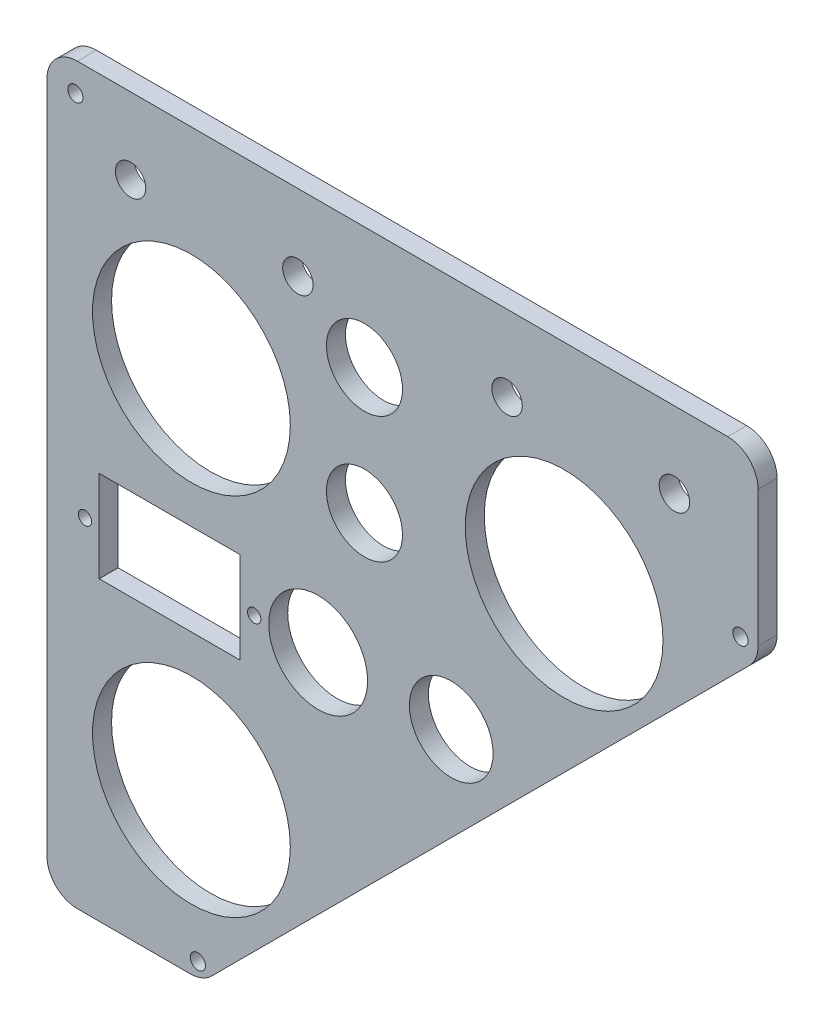
ISO-10303-21;
HEADER;
FILE_DESCRIPTION(('STEP AP214'),'2;1');
FILE_NAME('part.step','',(''),(''),'','','');
FILE_SCHEMA(('AUTOMOTIVE_DESIGN { 1 0 10303 214 1 1 1 1 }'));
ENDSEC;
DATA;
#1=APPLICATION_CONTEXT('core data for automotive mechanical design processes');
#2=APPLICATION_PROTOCOL_DEFINITION('international standard','automotive_design',2000,#1);
#3=PRODUCT_CONTEXT('',#1,'mechanical');
#4=PRODUCT('Part','Part','',(#3));
#5=PRODUCT_RELATED_PRODUCT_CATEGORY('part','',(#4));
#6=PRODUCT_DEFINITION_FORMATION('','',#4);
#7=PRODUCT_DEFINITION_CONTEXT('part definition',#1,'design');
#8=PRODUCT_DEFINITION('design','',#6,#7);
#9=PRODUCT_DEFINITION_SHAPE('','',#8);
#10=(LENGTH_UNIT() NAMED_UNIT(*) SI_UNIT(.MILLI.,.METRE.));
#11=(NAMED_UNIT(*) PLANE_ANGLE_UNIT() SI_UNIT($,.RADIAN.));
#12=(NAMED_UNIT(*) SI_UNIT($,.STERADIAN.) SOLID_ANGLE_UNIT());
#13=UNCERTAINTY_MEASURE_WITH_UNIT(LENGTH_MEASURE(1.E-05),#10,'distance_accuracy_value','');
#14=(GEOMETRIC_REPRESENTATION_CONTEXT(3) GLOBAL_UNCERTAINTY_ASSIGNED_CONTEXT((#13)) GLOBAL_UNIT_ASSIGNED_CONTEXT((#10,
#11,#12)) REPRESENTATION_CONTEXT('',''));
#15=CARTESIAN_POINT('',(0.,0.,0.));
#16=DIRECTION('',(0.,0.,1.));
#17=DIRECTION('',(1.,0.,0.));
#18=AXIS2_PLACEMENT_3D('',#15,#16,#17);
#19=CARTESIAN_POINT('',(8.,185.,5.));
#20=DIRECTION('',(0.,0.,-1.));
#21=DIRECTION('',(-1.,0.,0.));
#22=AXIS2_PLACEMENT_3D('',#19,#20,#21);
#23=CYLINDRICAL_SURFACE('',#22,8.);
#24=CARTESIAN_POINT('',(8.,185.,0.));
#25=DIRECTION('',(0.,0.,1.));
#26=DIRECTION('',(-1.,0.,0.));
#27=AXIS2_PLACEMENT_3D('',#24,#25,#26);
#28=CIRCLE('',#27,8.);
#29=CARTESIAN_POINT('',(8.,193.,0.));
#30=VERTEX_POINT('',#29);
#31=CARTESIAN_POINT('',(0.,185.,0.));
#32=VERTEX_POINT('',#31);
#33=EDGE_CURVE('E188',#30,#32,#28,.T.);
#34=ORIENTED_EDGE('',*,*,#33,.T.);
#35=DIRECTION('',(0.,0.,-1.));
#36=VECTOR('',#35,1.);
#37=CARTESIAN_POINT('',(0.,185.,5.));
#38=LINE('',#37,#36);
#39=CARTESIAN_POINT('',(0.,185.,5.));
#40=VERTEX_POINT('',#39);
#41=EDGE_CURVE('E235',#40,#32,#38,.T.);
#42=ORIENTED_EDGE('',*,*,#41,.F.);
#43=CARTESIAN_POINT('',(8.,185.,5.));
#44=DIRECTION('',(0.,0.,1.));
#45=DIRECTION('',(-1.,0.,0.));
#46=AXIS2_PLACEMENT_3D('',#43,#44,#45);
#47=CIRCLE('',#46,8.);
#48=CARTESIAN_POINT('',(8.,193.,5.));
#49=VERTEX_POINT('',#48);
#50=EDGE_CURVE('E165',#49,#40,#47,.T.);
#51=ORIENTED_EDGE('',*,*,#50,.F.);
#52=DIRECTION('',(0.,0.,-1.));
#53=VECTOR('',#52,1.);
#54=CARTESIAN_POINT('',(8.,193.,5.));
#55=LINE('',#54,#53);
#56=EDGE_CURVE('E187',#49,#30,#55,.T.);
#57=ORIENTED_EDGE('',*,*,#56,.T.);
#58=EDGE_LOOP('',(#34,#42,#51,#57));
#59=FACE_BOUND('',#58,.T.);
#60=ADVANCED_FACE('F35',(#59),#23,.T.);
#61=CARTESIAN_POINT('',(0.,8.,5.));
#62=DIRECTION('',(1.,0.,0.));
#63=DIRECTION('',(0.,1.,0.));
#64=AXIS2_PLACEMENT_3D('',#61,#62,#63);
#65=PLANE('',#64);
#66=DIRECTION('',(0.,-1.,0.));
#67=VECTOR('',#66,1.);
#68=CARTESIAN_POINT('',(0.,8.,0.));
#69=LINE('',#68,#67);
#70=CARTESIAN_POINT('',(0.,8.,0.));
#71=VERTEX_POINT('',#70);
#72=EDGE_CURVE('E191',#32,#71,#69,.T.);
#73=ORIENTED_EDGE('',*,*,#72,.T.);
#74=DIRECTION('',(0.,0.,-1.));
#75=VECTOR('',#74,1.);
#76=CARTESIAN_POINT('',(0.,8.,5.));
#77=LINE('',#76,#75);
#78=CARTESIAN_POINT('',(0.,8.,5.));
#79=VERTEX_POINT('',#78);
#80=EDGE_CURVE('E232',#79,#71,#77,.T.);
#81=ORIENTED_EDGE('',*,*,#80,.F.);
#82=DIRECTION('',(0.,-1.,0.));
#83=VECTOR('',#82,1.);
#84=CARTESIAN_POINT('',(0.,8.,5.));
#85=LINE('',#84,#83);
#86=EDGE_CURVE('E168',#40,#79,#85,.T.);
#87=ORIENTED_EDGE('',*,*,#86,.F.);
#88=ORIENTED_EDGE('',*,*,#41,.T.);
#89=EDGE_LOOP('',(#73,#81,#87,#88));
#90=FACE_BOUND('',#89,.T.);
#91=ADVANCED_FACE('F373',(#90),#65,.F.);
#92=CARTESIAN_POINT('',(8.,8.,5.));
#93=DIRECTION('',(0.,0.,-1.));
#94=DIRECTION('',(-1.,0.,0.));
#95=AXIS2_PLACEMENT_3D('',#92,#93,#94);
#96=CYLINDRICAL_SURFACE('',#95,8.);
#97=CARTESIAN_POINT('',(8.,8.,0.));
#98=DIRECTION('',(0.,0.,1.));
#99=DIRECTION('',(1.,0.,0.));
#100=AXIS2_PLACEMENT_3D('',#97,#98,#99);
#101=CIRCLE('',#100,8.);
#102=CARTESIAN_POINT('',(8.,0.,0.));
#103=VERTEX_POINT('',#102);
#104=EDGE_CURVE('E194',#71,#103,#101,.T.);
#105=ORIENTED_EDGE('',*,*,#104,.T.);
#106=DIRECTION('',(0.,0.,-1.));
#107=VECTOR('',#106,1.);
#108=CARTESIAN_POINT('',(8.,0.,5.));
#109=LINE('',#108,#107);
#110=CARTESIAN_POINT('',(8.,0.,5.));
#111=VERTEX_POINT('',#110);
#112=EDGE_CURVE('E229',#111,#103,#109,.T.);
#113=ORIENTED_EDGE('',*,*,#112,.F.);
#114=CARTESIAN_POINT('',(8.,8.,5.));
#115=DIRECTION('',(0.,0.,1.));
#116=DIRECTION('',(1.,0.,0.));
#117=AXIS2_PLACEMENT_3D('',#114,#115,#116);
#118=CIRCLE('',#117,8.);
#119=EDGE_CURVE('E171',#79,#111,#118,.T.);
#120=ORIENTED_EDGE('',*,*,#119,.F.);
#121=ORIENTED_EDGE('',*,*,#80,.T.);
#122=EDGE_LOOP('',(#105,#113,#120,#121));
#123=FACE_BOUND('',#122,.T.);
#124=ADVANCED_FACE('F378',(#123),#96,.T.);
#125=CARTESIAN_POINT('',(37.6862915010168,0.,5.));
#126=DIRECTION('',(0.,1.,0.));
#127=DIRECTION('',(-1.,0.,0.));
#128=AXIS2_PLACEMENT_3D('',#125,#126,#127);
#129=PLANE('',#128);
#130=DIRECTION('',(1.,0.,0.));
#131=VECTOR('',#130,1.);
#132=CARTESIAN_POINT('',(37.6862915010168,0.,0.));
#133=LINE('',#132,#131);
#134=CARTESIAN_POINT('',(37.6862915010168,0.,0.));
#135=VERTEX_POINT('',#134);
#136=EDGE_CURVE('E196',#103,#135,#133,.T.);
#137=ORIENTED_EDGE('',*,*,#136,.T.);
#138=DIRECTION('',(0.,0.,-1.));
#139=VECTOR('',#138,1.);
#140=CARTESIAN_POINT('',(37.6862915010168,0.,5.));
#141=LINE('',#140,#139);
#142=CARTESIAN_POINT('',(37.6862915010168,0.,5.));
#143=VERTEX_POINT('',#142);
#144=EDGE_CURVE('E226',#143,#135,#141,.T.);
#145=ORIENTED_EDGE('',*,*,#144,.F.);
#146=DIRECTION('',(1.,0.,0.));
#147=VECTOR('',#146,1.);
#148=CARTESIAN_POINT('',(37.6862915010168,0.,5.));
#149=LINE('',#148,#147);
#150=EDGE_CURVE('E173',#111,#143,#149,.T.);
#151=ORIENTED_EDGE('',*,*,#150,.F.);
#152=ORIENTED_EDGE('',*,*,#112,.T.);
#153=EDGE_LOOP('',(#137,#145,#151,#152));
#154=FACE_BOUND('',#153,.T.);
#155=ADVANCED_FACE('F420',(#154),#129,.F.);
#156=CARTESIAN_POINT('',(37.6862915010168,8.00000000000001,5.));
#157=DIRECTION('',(0.,0.,-1.));
#158=DIRECTION('',(-1.,0.,0.));
#159=AXIS2_PLACEMENT_3D('',#156,#157,#158);
#160=CYLINDRICAL_SURFACE('',#159,8.);
#161=CARTESIAN_POINT('',(37.6862915010168,8.00000000000001,0.));
#162=DIRECTION('',(0.,0.,1.));
#163=DIRECTION('',(-1.,0.,0.));
#164=AXIS2_PLACEMENT_3D('',#161,#162,#163);
#165=CIRCLE('',#164,8.);
#166=CARTESIAN_POINT('',(43.3431457505092,2.34314575050765,0.));
#167=VERTEX_POINT('',#166);
#168=EDGE_CURVE('E198',#135,#167,#165,.T.);
#169=ORIENTED_EDGE('',*,*,#168,.T.);
#170=DIRECTION('',(0.,0.,-1.));
#171=VECTOR('',#170,1.);
#172=CARTESIAN_POINT('',(43.3431457505092,2.34314575050765,5.));
#173=LINE('',#172,#171);
#174=CARTESIAN_POINT('',(43.3431457505092,2.34314575050765,5.));
#175=VERTEX_POINT('',#174);
#176=EDGE_CURVE('E223',#175,#167,#173,.T.);
#177=ORIENTED_EDGE('',*,*,#176,.F.);
#178=CARTESIAN_POINT('',(37.6862915010168,8.00000000000001,5.));
#179=DIRECTION('',(0.,0.,1.));
#180=DIRECTION('',(-1.,0.,0.));
#181=AXIS2_PLACEMENT_3D('',#178,#179,#180);
#182=CIRCLE('',#181,8.);
#183=EDGE_CURVE('E175',#143,#175,#182,.T.);
#184=ORIENTED_EDGE('',*,*,#183,.F.);
#185=ORIENTED_EDGE('',*,*,#144,.T.);
#186=EDGE_LOOP('',(#169,#177,#184,#185));
#187=FACE_BOUND('',#186,.T.);
#188=ADVANCED_FACE('F415',(#187),#160,.T.);
#189=CARTESIAN_POINT('',(184.656854249492,143.656854249492,5.));
#190=DIRECTION('',(-0.707106781186552,0.707106781186544,0.));
#191=DIRECTION('',(-0.707106781186544,-0.707106781186552,0.));
#192=AXIS2_PLACEMENT_3D('',#189,#190,#191);
#193=PLANE('',#192);
#194=DIRECTION('',(0.707106781186543,0.707106781186551,0.));
#195=VECTOR('',#194,1.);
#196=CARTESIAN_POINT('',(184.656854249492,143.656854249492,0.));
#197=LINE('',#196,#195);
#198=CARTESIAN_POINT('',(184.656854249492,143.656854249492,0.));
#199=VERTEX_POINT('',#198);
#200=EDGE_CURVE('E200',#167,#199,#197,.T.);
#201=ORIENTED_EDGE('',*,*,#200,.T.);
#202=DIRECTION('',(0.,0.,-1.));
#203=VECTOR('',#202,1.);
#204=CARTESIAN_POINT('',(184.656854249492,143.656854249492,5.));
#205=LINE('',#204,#203);
#206=CARTESIAN_POINT('',(184.656854249492,143.656854249492,5.));
#207=VERTEX_POINT('',#206);
#208=EDGE_CURVE('E220',#207,#199,#205,.T.);
#209=ORIENTED_EDGE('',*,*,#208,.F.);
#210=DIRECTION('',(0.707106781186543,0.707106781186551,0.));
#211=VECTOR('',#210,1.);
#212=CARTESIAN_POINT('',(184.656854249492,143.656854249492,5.));
#213=LINE('',#212,#211);
#214=EDGE_CURVE('E177',#175,#207,#213,.T.);
#215=ORIENTED_EDGE('',*,*,#214,.F.);
#216=ORIENTED_EDGE('',*,*,#176,.T.);
#217=EDGE_LOOP('',(#201,#209,#215,#216));
#218=FACE_BOUND('',#217,.T.);
#219=ADVANCED_FACE('F411',(#218),#193,.F.);
#220=CARTESIAN_POINT('',(179.,149.313708498985,5.));
#221=DIRECTION('',(0.,0.,-1.));
#222=DIRECTION('',(-1.,0.,0.));
#223=AXIS2_PLACEMENT_3D('',#220,#221,#222);
#224=CYLINDRICAL_SURFACE('',#223,7.99999999999998);
#225=CARTESIAN_POINT('',(179.,149.313708498985,0.));
#226=DIRECTION('',(0.,0.,1.));
#227=DIRECTION('',(-1.,0.,0.));
#228=AXIS2_PLACEMENT_3D('',#225,#226,#227);
#229=CIRCLE('',#228,7.99999999999998);
#230=CARTESIAN_POINT('',(187.,149.313708498985,0.));
#231=VERTEX_POINT('',#230);
#232=EDGE_CURVE('E202',#199,#231,#229,.T.);
#233=ORIENTED_EDGE('',*,*,#232,.T.);
#234=DIRECTION('',(0.,0.,-1.));
#235=VECTOR('',#234,1.);
#236=CARTESIAN_POINT('',(187.,149.313708498985,5.));
#237=LINE('',#236,#235);
#238=CARTESIAN_POINT('',(187.,149.313708498985,5.));
#239=VERTEX_POINT('',#238);
#240=EDGE_CURVE('E217',#239,#231,#237,.T.);
#241=ORIENTED_EDGE('',*,*,#240,.F.);
#242=CARTESIAN_POINT('',(179.,149.313708498985,5.));
#243=DIRECTION('',(0.,0.,1.));
#244=DIRECTION('',(-1.,0.,0.));
#245=AXIS2_PLACEMENT_3D('',#242,#243,#244);
#246=CIRCLE('',#245,7.99999999999998);
#247=EDGE_CURVE('E179',#207,#239,#246,.T.);
#248=ORIENTED_EDGE('',*,*,#247,.F.);
#249=ORIENTED_EDGE('',*,*,#208,.T.);
#250=EDGE_LOOP('',(#233,#241,#248,#249));
#251=FACE_BOUND('',#250,.T.);
#252=ADVANCED_FACE('F407',(#251),#224,.T.);
#253=CARTESIAN_POINT('',(187.,185.,5.));
#254=DIRECTION('',(-1.,0.,0.));
#255=DIRECTION('',(0.,0.,1.));
#256=AXIS2_PLACEMENT_3D('',#253,#254,#255);
#257=PLANE('',#256);
#258=DIRECTION('',(0.,1.,0.));
#259=VECTOR('',#258,1.);
#260=CARTESIAN_POINT('',(187.,185.,0.));
#261=LINE('',#260,#259);
#262=CARTESIAN_POINT('',(187.,185.,0.));
#263=VERTEX_POINT('',#262);
#264=EDGE_CURVE('E204',#231,#263,#261,.T.);
#265=ORIENTED_EDGE('',*,*,#264,.T.);
#266=DIRECTION('',(0.,0.,-1.));
#267=VECTOR('',#266,1.);
#268=CARTESIAN_POINT('',(187.,185.,5.));
#269=LINE('',#268,#267);
#270=CARTESIAN_POINT('',(187.,185.,5.));
#271=VERTEX_POINT('',#270);
#272=EDGE_CURVE('E214',#271,#263,#269,.T.);
#273=ORIENTED_EDGE('',*,*,#272,.F.);
#274=DIRECTION('',(0.,1.,0.));
#275=VECTOR('',#274,1.);
#276=CARTESIAN_POINT('',(187.,185.,5.));
#277=LINE('',#276,#275);
#278=EDGE_CURVE('E181',#239,#271,#277,.T.);
#279=ORIENTED_EDGE('',*,*,#278,.F.);
#280=ORIENTED_EDGE('',*,*,#240,.T.);
#281=EDGE_LOOP('',(#265,#273,#279,#280));
#282=FACE_BOUND('',#281,.T.);
#283=ADVANCED_FACE('F402',(#282),#257,.F.);
#284=CARTESIAN_POINT('',(179.,185.,5.));
#285=DIRECTION('',(0.,0.,-1.));
#286=DIRECTION('',(-1.,0.,0.));
#287=AXIS2_PLACEMENT_3D('',#284,#285,#286);
#288=CYLINDRICAL_SURFACE('',#287,8.00000000000001);
#289=CARTESIAN_POINT('',(179.,185.,0.));
#290=DIRECTION('',(0.,0.,1.));
#291=DIRECTION('',(-1.,0.,0.));
#292=AXIS2_PLACEMENT_3D('',#289,#290,#291);
#293=CIRCLE('',#292,8.00000000000001);
#294=CARTESIAN_POINT('',(179.,193.,0.));
#295=VERTEX_POINT('',#294);
#296=EDGE_CURVE('E206',#263,#295,#293,.T.);
#297=ORIENTED_EDGE('',*,*,#296,.T.);
#298=DIRECTION('',(0.,0.,-1.));
#299=VECTOR('',#298,1.);
#300=CARTESIAN_POINT('',(179.,193.,5.));
#301=LINE('',#300,#299);
#302=CARTESIAN_POINT('',(179.,193.,5.));
#303=VERTEX_POINT('',#302);
#304=EDGE_CURVE('E211',#303,#295,#301,.T.);
#305=ORIENTED_EDGE('',*,*,#304,.F.);
#306=CARTESIAN_POINT('',(179.,185.,5.));
#307=DIRECTION('',(0.,0.,1.));
#308=DIRECTION('',(-1.,0.,0.));
#309=AXIS2_PLACEMENT_3D('',#306,#307,#308);
#310=CIRCLE('',#309,8.00000000000001);
#311=EDGE_CURVE('E183',#271,#303,#310,.T.);
#312=ORIENTED_EDGE('',*,*,#311,.F.);
#313=ORIENTED_EDGE('',*,*,#272,.T.);
#314=EDGE_LOOP('',(#297,#305,#312,#313));
#315=FACE_BOUND('',#314,.T.);
#316=ADVANCED_FACE('F396',(#315),#288,.T.);
#317=CARTESIAN_POINT('',(8.,193.,5.));
#318=DIRECTION('',(0.,-1.,0.));
#319=DIRECTION('',(0.,0.,-1.));
#320=AXIS2_PLACEMENT_3D('',#317,#318,#319);
#321=PLANE('',#320);
#322=DIRECTION('',(-1.,0.,0.));
#323=VECTOR('',#322,1.);
#324=CARTESIAN_POINT('',(8.,193.,0.));
#325=LINE('',#324,#323);
#326=EDGE_CURVE('E169',#295,#30,#325,.T.);
#327=ORIENTED_EDGE('',*,*,#326,.T.);
#328=ORIENTED_EDGE('',*,*,#56,.F.);
#329=DIRECTION('',(-1.,0.,0.));
#330=VECTOR('',#329,1.);
#331=CARTESIAN_POINT('',(8.,193.,5.));
#332=LINE('',#331,#330);
#333=EDGE_CURVE('E185',#303,#49,#332,.T.);
#334=ORIENTED_EDGE('',*,*,#333,.F.);
#335=ORIENTED_EDGE('',*,*,#304,.T.);
#336=EDGE_LOOP('',(#327,#328,#334,#335));
#337=FACE_BOUND('',#336,.T.);
#338=ADVANCED_FACE('F346',(#337),#321,.F.);
#339=CARTESIAN_POINT('',(8.,185.,5.));
#340=DIRECTION('',(0.,0.,-1.));
#341=DIRECTION('',(-1.,0.,0.));
#342=AXIS2_PLACEMENT_3D('',#339,#340,#341);
#343=PLANE('',#342);
#344=CARTESIAN_POINT('',(182.36,149.12,5.));
#345=DIRECTION('',(0.,0.,-1.));
#346=DIRECTION('',(-1.,0.,0.));
#347=AXIS2_PLACEMENT_3D('',#344,#345,#346);
#348=CIRCLE('',#347,2.);
#349=CARTESIAN_POINT('',(180.36,149.12,5.));
#350=VERTEX_POINT('',#349);
#351=EDGE_CURVE('E38',#350,#350,#348,.T.);
#352=ORIENTED_EDGE('',*,*,#351,.T.);
#353=EDGE_LOOP('',(#352));
#354=FACE_BOUND('',#353,.T.);
#355=CARTESIAN_POINT('',(7.49999999999996,185.4,5.));
#356=DIRECTION('',(0.,0.,-1.));
#357=DIRECTION('',(-1.,0.,0.));
#358=AXIS2_PLACEMENT_3D('',#355,#356,#357);
#359=CIRCLE('',#358,1.99999999999999);
#360=CARTESIAN_POINT('',(5.49999999999996,185.4,5.));
#361=VERTEX_POINT('',#360);
#362=EDGE_CURVE('E285',#361,#361,#359,.T.);
#363=ORIENTED_EDGE('',*,*,#362,.T.);
#364=EDGE_LOOP('',(#363));
#365=FACE_BOUND('',#364,.T.);
#366=CARTESIAN_POINT('',(39.6899999999999,3.83000000000003,5.));
#367=DIRECTION('',(0.,0.,-1.));
#368=DIRECTION('',(-1.,0.,0.));
#369=AXIS2_PLACEMENT_3D('',#366,#367,#368);
#370=CIRCLE('',#369,1.99999999999999);
#371=CARTESIAN_POINT('',(37.6899999999999,3.83000000000003,5.));
#372=VERTEX_POINT('',#371);
#373=EDGE_CURVE('E281',#372,#372,#370,.T.);
#374=ORIENTED_EDGE('',*,*,#373,.T.);
#375=EDGE_LOOP('',(#374));
#376=FACE_BOUND('',#375,.T.);
#377=CARTESIAN_POINT('',(22.,173.,5.));
#378=DIRECTION('',(0.,0.,1.));
#379=DIRECTION('',(1.,0.,0.));
#380=AXIS2_PLACEMENT_3D('',#377,#378,#379);
#381=CIRCLE('',#380,4.);
#382=CARTESIAN_POINT('',(26.,173.,5.));
#383=VERTEX_POINT('',#382);
#384=EDGE_CURVE('E271',#383,#383,#381,.T.);
#385=ORIENTED_EDGE('',*,*,#384,.F.);
#386=EDGE_LOOP('',(#385));
#387=FACE_BOUND('',#386,.T.);
#388=CARTESIAN_POINT('',(66.,173.,5.));
#389=DIRECTION('',(0.,0.,1.));
#390=DIRECTION('',(1.,0.,0.));
#391=AXIS2_PLACEMENT_3D('',#388,#389,#390);
#392=CIRCLE('',#391,4.00000000000002);
#393=CARTESIAN_POINT('',(70.,173.,5.));
#394=VERTEX_POINT('',#393);
#395=EDGE_CURVE('E306',#394,#394,#392,.T.);
#396=ORIENTED_EDGE('',*,*,#395,.F.);
#397=EDGE_LOOP('',(#396));
#398=FACE_BOUND('',#397,.T.);
#399=CARTESIAN_POINT('',(121.,173.,5.));
#400=DIRECTION('',(0.,0.,1.));
#401=DIRECTION('',(1.,0.,0.));
#402=AXIS2_PLACEMENT_3D('',#399,#400,#401);
#403=CIRCLE('',#402,4.00000000000001);
#404=CARTESIAN_POINT('',(125.,173.,5.));
#405=VERTEX_POINT('',#404);
#406=EDGE_CURVE('E309',#405,#405,#403,.T.);
#407=ORIENTED_EDGE('',*,*,#406,.F.);
#408=EDGE_LOOP('',(#407));
#409=FACE_BOUND('',#408,.T.);
#410=CARTESIAN_POINT('',(165.,173.,5.));
#411=DIRECTION('',(0.,0.,1.));
#412=DIRECTION('',(1.,0.,0.));
#413=AXIS2_PLACEMENT_3D('',#410,#411,#412);
#414=CIRCLE('',#413,3.99999999999999);
#415=CARTESIAN_POINT('',(169.,173.,5.));
#416=VERTEX_POINT('',#415);
#417=EDGE_CURVE('E283',#416,#416,#414,.T.);
#418=ORIENTED_EDGE('',*,*,#417,.F.);
#419=EDGE_LOOP('',(#418));
#420=FACE_BOUND('',#419,.T.);
#421=CARTESIAN_POINT('',(136.,138.,5.));
#422=DIRECTION('',(0.,0.,1.));
#423=DIRECTION('',(1.,0.,0.));
#424=AXIS2_PLACEMENT_3D('',#421,#422,#423);
#425=CIRCLE('',#424,26.);
#426=CARTESIAN_POINT('',(162.,138.,5.));
#427=VERTEX_POINT('',#426);
#428=EDGE_CURVE('E323',#427,#427,#425,.T.);
#429=ORIENTED_EDGE('',*,*,#428,.F.);
#430=EDGE_LOOP('',(#429));
#431=FACE_BOUND('',#430,.T.);
#432=CARTESIAN_POINT('',(71.3195099864327,90.,5.));
#433=DIRECTION('',(0.,0.,1.));
#434=DIRECTION('',(1.,0.,0.));
#435=AXIS2_PLACEMENT_3D('',#432,#433,#434);
#436=CIRCLE('',#435,13.);
#437=CARTESIAN_POINT('',(84.3195099864327,90.,5.));
#438=VERTEX_POINT('',#437);
#439=EDGE_CURVE('E320',#438,#438,#436,.T.);
#440=ORIENTED_EDGE('',*,*,#439,.F.);
#441=EDGE_LOOP('',(#440));
#442=FACE_BOUND('',#441,.T.);
#443=CARTESIAN_POINT('',(38.,42.,5.));
#444=DIRECTION('',(0.,0.,1.));
#445=DIRECTION('',(1.,0.,0.));
#446=AXIS2_PLACEMENT_3D('',#443,#444,#445);
#447=CIRCLE('',#446,26.);
#448=CARTESIAN_POINT('',(64.,42.,5.));
#449=VERTEX_POINT('',#448);
#450=EDGE_CURVE('E317',#449,#449,#447,.T.);
#451=ORIENTED_EDGE('',*,*,#450,.F.);
#452=EDGE_LOOP('',(#451));
#453=FACE_BOUND('',#452,.T.);
#454=CARTESIAN_POINT('',(38.,138.,5.));
#455=DIRECTION('',(0.,0.,1.));
#456=DIRECTION('',(1.,0.,0.));
#457=AXIS2_PLACEMENT_3D('',#454,#455,#456);
#458=CIRCLE('',#457,26.);
#459=CARTESIAN_POINT('',(64.,138.,5.));
#460=VERTEX_POINT('',#459);
#461=EDGE_CURVE('E316',#460,#460,#458,.T.);
#462=ORIENTED_EDGE('',*,*,#461,.F.);
#463=EDGE_LOOP('',(#462));
#464=FACE_BOUND('',#463,.T.);
#465=CARTESIAN_POINT('',(106.319509986433,90.,5.));
#466=DIRECTION('',(0.,0.,1.));
#467=DIRECTION('',(1.,0.,0.));
#468=AXIS2_PLACEMENT_3D('',#465,#466,#467);
#469=CIRCLE('',#468,11.);
#470=CARTESIAN_POINT('',(117.319509986433,90.,5.));
#471=VERTEX_POINT('',#470);
#472=EDGE_CURVE('E326',#471,#471,#469,.T.);
#473=ORIENTED_EDGE('',*,*,#472,.F.);
#474=EDGE_LOOP('',(#473));
#475=FACE_BOUND('',#474,.T.);
#476=CARTESIAN_POINT('',(83.5,161.,5.));
#477=DIRECTION('',(0.,0.,1.));
#478=DIRECTION('',(1.,0.,0.));
#479=AXIS2_PLACEMENT_3D('',#476,#477,#478);
#480=CIRCLE('',#479,9.99999999999747);
#481=CARTESIAN_POINT('',(93.4999999999975,161.,5.));
#482=VERTEX_POINT('',#481);
#483=EDGE_CURVE('E335',#482,#482,#480,.T.);
#484=ORIENTED_EDGE('',*,*,#483,.F.);
#485=EDGE_LOOP('',(#484));
#486=FACE_BOUND('',#485,.T.);
#487=CARTESIAN_POINT('',(54.5,90.,5.));
#488=DIRECTION('',(0.,0.,1.));
#489=DIRECTION('',(1.,0.,0.));
#490=AXIS2_PLACEMENT_3D('',#487,#488,#489);
#491=CIRCLE('',#490,1.75000000000001);
#492=CARTESIAN_POINT('',(56.25,90.,5.));
#493=VERTEX_POINT('',#492);
#494=EDGE_CURVE('E332',#493,#493,#491,.T.);
#495=ORIENTED_EDGE('',*,*,#494,.F.);
#496=EDGE_LOOP('',(#495));
#497=FACE_BOUND('',#496,.T.);
#498=CARTESIAN_POINT('',(10.,90.,5.));
#499=DIRECTION('',(0.,0.,1.));
#500=DIRECTION('',(1.,0.,0.));
#501=AXIS2_PLACEMENT_3D('',#498,#499,#500);
#502=CIRCLE('',#501,1.75000000000001);
#503=CARTESIAN_POINT('',(11.75,90.,5.));
#504=VERTEX_POINT('',#503);
#505=EDGE_CURVE('E329',#504,#504,#502,.T.);
#506=ORIENTED_EDGE('',*,*,#505,.F.);
#507=EDGE_LOOP('',(#506));
#508=FACE_BOUND('',#507,.T.);
#509=CARTESIAN_POINT('',(83.5,127.850051572618,5.));
#510=DIRECTION('',(0.,0.,1.));
#511=DIRECTION('',(1.,0.,0.));
#512=AXIS2_PLACEMENT_3D('',#509,#510,#511);
#513=CIRCLE('',#512,9.99999999999831);
#514=CARTESIAN_POINT('',(93.4999999999984,127.850051572618,5.));
#515=VERTEX_POINT('',#514);
#516=EDGE_CURVE('E280',#515,#515,#513,.T.);
#517=ORIENTED_EDGE('',*,*,#516,.F.);
#518=EDGE_LOOP('',(#517));
#519=FACE_BOUND('',#518,.T.);
#520=DIRECTION('',(0.,1.,0.));
#521=VECTOR('',#520,1.);
#522=CARTESIAN_POINT('',(50.75,102.,5.));
#523=LINE('',#522,#521);
#524=CARTESIAN_POINT('',(50.75,78.,5.));
#525=VERTEX_POINT('',#524);
#526=CARTESIAN_POINT('',(50.75,102.,5.));
#527=VERTEX_POINT('',#526);
#528=EDGE_CURVE('E148',#525,#527,#523,.T.);
#529=ORIENTED_EDGE('',*,*,#528,.F.);
#530=DIRECTION('',(1.,0.,0.));
#531=VECTOR('',#530,1.);
#532=CARTESIAN_POINT('',(50.75,78.,5.));
#533=LINE('',#532,#531);
#534=CARTESIAN_POINT('',(13.75,78.,5.));
#535=VERTEX_POINT('',#534);
#536=EDGE_CURVE('E51',#535,#525,#533,.T.);
#537=ORIENTED_EDGE('',*,*,#536,.F.);
#538=DIRECTION('',(0.,-1.,0.));
#539=VECTOR('',#538,1.);
#540=CARTESIAN_POINT('',(13.75,78.,5.));
#541=LINE('',#540,#539);
#542=CARTESIAN_POINT('',(13.75,102.,5.));
#543=VERTEX_POINT('',#542);
#544=EDGE_CURVE('E155',#543,#535,#541,.T.);
#545=ORIENTED_EDGE('',*,*,#544,.F.);
#546=DIRECTION('',(-1.,0.,0.));
#547=VECTOR('',#546,1.);
#548=CARTESIAN_POINT('',(13.75,102.,5.));
#549=LINE('',#548,#547);
#550=EDGE_CURVE('E139',#527,#543,#549,.T.);
#551=ORIENTED_EDGE('',*,*,#550,.F.);
#552=EDGE_LOOP('',(#529,#537,#545,#551));
#553=FACE_BOUND('',#552,.T.);
#554=ORIENTED_EDGE('',*,*,#50,.T.);
#555=ORIENTED_EDGE('',*,*,#86,.T.);
#556=ORIENTED_EDGE('',*,*,#119,.T.);
#557=ORIENTED_EDGE('',*,*,#150,.T.);
#558=ORIENTED_EDGE('',*,*,#183,.T.);
#559=ORIENTED_EDGE('',*,*,#214,.T.);
#560=ORIENTED_EDGE('',*,*,#247,.T.);
#561=ORIENTED_EDGE('',*,*,#278,.T.);
#562=ORIENTED_EDGE('',*,*,#311,.T.);
#563=ORIENTED_EDGE('',*,*,#333,.T.);
#564=EDGE_LOOP('',(#554,#555,#556,#557,#558,#559,#560,#561,#562,#563));
#565=FACE_BOUND('',#564,.T.);
#566=ADVANCED_FACE('F152',(#354,#365,#376,#387,#398,#409,#420,#431,#442,#453,#464,#475,#486,
#497,#508,#519,#553,#565),#343,.F.);
#567=CARTESIAN_POINT('',(8.,185.,0.));
#568=DIRECTION('',(0.,0.,-1.));
#569=DIRECTION('',(-1.,0.,0.));
#570=AXIS2_PLACEMENT_3D('',#567,#568,#569);
#571=PLANE('',#570);
#572=CARTESIAN_POINT('',(182.36,149.12,0.));
#573=DIRECTION('',(0.,0.,-1.));
#574=DIRECTION('',(-1.,0.,0.));
#575=AXIS2_PLACEMENT_3D('',#572,#573,#574);
#576=CIRCLE('',#575,2.025);
#577=CARTESIAN_POINT('',(180.335,149.12,0.));
#578=VERTEX_POINT('',#577);
#579=EDGE_CURVE('E755',#578,#578,#576,.T.);
#580=ORIENTED_EDGE('',*,*,#579,.F.);
#581=EDGE_LOOP('',(#580));
#582=FACE_BOUND('',#581,.T.);
#583=CARTESIAN_POINT('',(7.49999999999996,185.4,0.));
#584=DIRECTION('',(0.,0.,-1.));
#585=DIRECTION('',(-1.,0.,0.));
#586=AXIS2_PLACEMENT_3D('',#583,#584,#585);
#587=CIRCLE('',#586,2.025);
#588=CARTESIAN_POINT('',(5.47499999999996,185.4,0.));
#589=VERTEX_POINT('',#588);
#590=EDGE_CURVE('E294',#589,#589,#587,.T.);
#591=ORIENTED_EDGE('',*,*,#590,.F.);
#592=EDGE_LOOP('',(#591));
#593=FACE_BOUND('',#592,.T.);
#594=CARTESIAN_POINT('',(39.6899999999999,3.83000000000003,0.));
#595=DIRECTION('',(0.,0.,-1.));
#596=DIRECTION('',(-1.,0.,0.));
#597=AXIS2_PLACEMENT_3D('',#594,#595,#596);
#598=CIRCLE('',#597,2.025);
#599=CARTESIAN_POINT('',(37.6649999999999,3.83000000000003,0.));
#600=VERTEX_POINT('',#599);
#601=EDGE_CURVE('E287',#600,#600,#598,.T.);
#602=ORIENTED_EDGE('',*,*,#601,.F.);
#603=EDGE_LOOP('',(#602));
#604=FACE_BOUND('',#603,.T.);
#605=CARTESIAN_POINT('',(22.,173.,0.));
#606=DIRECTION('',(0.,0.,-1.));
#607=DIRECTION('',(-1.,0.,0.));
#608=AXIS2_PLACEMENT_3D('',#605,#606,#607);
#609=CIRCLE('',#608,4.);
#610=CARTESIAN_POINT('',(18.,173.,0.));
#611=VERTEX_POINT('',#610);
#612=EDGE_CURVE('E277',#611,#611,#609,.T.);
#613=ORIENTED_EDGE('',*,*,#612,.F.);
#614=EDGE_LOOP('',(#613));
#615=FACE_BOUND('',#614,.T.);
#616=CARTESIAN_POINT('',(66.,173.,0.));
#617=DIRECTION('',(0.,0.,-1.));
#618=DIRECTION('',(-1.,0.,0.));
#619=AXIS2_PLACEMENT_3D('',#616,#617,#618);
#620=CIRCLE('',#619,4.00000000000002);
#621=CARTESIAN_POINT('',(62.,173.,0.));
#622=VERTEX_POINT('',#621);
#623=EDGE_CURVE('E274',#622,#622,#620,.T.);
#624=ORIENTED_EDGE('',*,*,#623,.F.);
#625=EDGE_LOOP('',(#624));
#626=FACE_BOUND('',#625,.T.);
#627=CARTESIAN_POINT('',(121.,173.,0.));
#628=DIRECTION('',(0.,0.,-1.));
#629=DIRECTION('',(-1.,0.,0.));
#630=AXIS2_PLACEMENT_3D('',#627,#628,#629);
#631=CIRCLE('',#630,4.00000000000001);
#632=CARTESIAN_POINT('',(117.,173.,0.));
#633=VERTEX_POINT('',#632);
#634=EDGE_CURVE('E270',#633,#633,#631,.T.);
#635=ORIENTED_EDGE('',*,*,#634,.F.);
#636=EDGE_LOOP('',(#635));
#637=FACE_BOUND('',#636,.T.);
#638=CARTESIAN_POINT('',(165.,173.,0.));
#639=DIRECTION('',(0.,0.,-1.));
#640=DIRECTION('',(-1.,0.,0.));
#641=AXIS2_PLACEMENT_3D('',#638,#639,#640);
#642=CIRCLE('',#641,3.99999999999999);
#643=CARTESIAN_POINT('',(161.,173.,0.));
#644=VERTEX_POINT('',#643);
#645=EDGE_CURVE('E267',#644,#644,#642,.T.);
#646=ORIENTED_EDGE('',*,*,#645,.F.);
#647=EDGE_LOOP('',(#646));
#648=FACE_BOUND('',#647,.T.);
#649=CARTESIAN_POINT('',(136.,138.,0.));
#650=DIRECTION('',(0.,0.,-1.));
#651=DIRECTION('',(-1.,0.,0.));
#652=AXIS2_PLACEMENT_3D('',#649,#650,#651);
#653=CIRCLE('',#652,26.);
#654=CARTESIAN_POINT('',(110.,138.,0.));
#655=VERTEX_POINT('',#654);
#656=EDGE_CURVE('E192',#655,#655,#653,.T.);
#657=ORIENTED_EDGE('',*,*,#656,.F.);
#658=EDGE_LOOP('',(#657));
#659=FACE_BOUND('',#658,.T.);
#660=CARTESIAN_POINT('',(71.3195099864327,90.,0.));
#661=DIRECTION('',(0.,0.,-1.));
#662=DIRECTION('',(-1.,0.,0.));
#663=AXIS2_PLACEMENT_3D('',#660,#661,#662);
#664=CIRCLE('',#663,13.);
#665=CARTESIAN_POINT('',(58.3195099864327,90.,0.));
#666=VERTEX_POINT('',#665);
#667=EDGE_CURVE('E262',#666,#666,#664,.T.);
#668=ORIENTED_EDGE('',*,*,#667,.F.);
#669=EDGE_LOOP('',(#668));
#670=FACE_BOUND('',#669,.T.);
#671=CARTESIAN_POINT('',(38.,42.,0.));
#672=DIRECTION('',(0.,0.,-1.));
#673=DIRECTION('',(-1.,0.,0.));
#674=AXIS2_PLACEMENT_3D('',#671,#672,#673);
#675=CIRCLE('',#674,26.);
#676=CARTESIAN_POINT('',(12.,42.,0.));
#677=VERTEX_POINT('',#676);
#678=EDGE_CURVE('E259',#677,#677,#675,.T.);
#679=ORIENTED_EDGE('',*,*,#678,.F.);
#680=EDGE_LOOP('',(#679));
#681=FACE_BOUND('',#680,.T.);
#682=CARTESIAN_POINT('',(38.,138.,0.));
#683=DIRECTION('',(0.,0.,-1.));
#684=DIRECTION('',(-1.,0.,0.));
#685=AXIS2_PLACEMENT_3D('',#682,#683,#684);
#686=CIRCLE('',#685,26.);
#687=CARTESIAN_POINT('',(12.,138.,0.));
#688=VERTEX_POINT('',#687);
#689=EDGE_CURVE('E256',#688,#688,#686,.T.);
#690=ORIENTED_EDGE('',*,*,#689,.F.);
#691=EDGE_LOOP('',(#690));
#692=FACE_BOUND('',#691,.T.);
#693=CARTESIAN_POINT('',(106.319509986433,90.,0.));
#694=DIRECTION('',(0.,0.,-1.));
#695=DIRECTION('',(-1.,0.,0.));
#696=AXIS2_PLACEMENT_3D('',#693,#694,#695);
#697=CIRCLE('',#696,11.);
#698=CARTESIAN_POINT('',(95.3195099864327,90.,0.));
#699=VERTEX_POINT('',#698);
#700=EDGE_CURVE('E253',#699,#699,#697,.T.);
#701=ORIENTED_EDGE('',*,*,#700,.F.);
#702=EDGE_LOOP('',(#701));
#703=FACE_BOUND('',#702,.T.);
#704=CARTESIAN_POINT('',(83.5,161.,0.));
#705=DIRECTION('',(0.,0.,-1.));
#706=DIRECTION('',(-1.,0.,0.));
#707=AXIS2_PLACEMENT_3D('',#704,#705,#706);
#708=CIRCLE('',#707,9.99999999999747);
#709=CARTESIAN_POINT('',(73.5000000000025,161.,0.));
#710=VERTEX_POINT('',#709);
#711=EDGE_CURVE('E250',#710,#710,#708,.T.);
#712=ORIENTED_EDGE('',*,*,#711,.F.);
#713=EDGE_LOOP('',(#712));
#714=FACE_BOUND('',#713,.T.);
#715=CARTESIAN_POINT('',(54.5,90.,0.));
#716=DIRECTION('',(0.,0.,-1.));
#717=DIRECTION('',(-1.,0.,0.));
#718=AXIS2_PLACEMENT_3D('',#715,#716,#717);
#719=CIRCLE('',#718,1.75000000000001);
#720=CARTESIAN_POINT('',(52.75,90.,0.));
#721=VERTEX_POINT('',#720);
#722=EDGE_CURVE('E247',#721,#721,#719,.T.);
#723=ORIENTED_EDGE('',*,*,#722,.F.);
#724=EDGE_LOOP('',(#723));
#725=FACE_BOUND('',#724,.T.);
#726=CARTESIAN_POINT('',(10.,90.,0.));
#727=DIRECTION('',(0.,0.,-1.));
#728=DIRECTION('',(-1.,0.,0.));
#729=AXIS2_PLACEMENT_3D('',#726,#727,#728);
#730=CIRCLE('',#729,1.75000000000001);
#731=CARTESIAN_POINT('',(8.24999999999999,90.,0.));
#732=VERTEX_POINT('',#731);
#733=EDGE_CURVE('E244',#732,#732,#730,.T.);
#734=ORIENTED_EDGE('',*,*,#733,.F.);
#735=EDGE_LOOP('',(#734));
#736=FACE_BOUND('',#735,.T.);
#737=CARTESIAN_POINT('',(83.5,127.850051572618,0.));
#738=DIRECTION('',(0.,0.,-1.));
#739=DIRECTION('',(-1.,0.,0.));
#740=AXIS2_PLACEMENT_3D('',#737,#738,#739);
#741=CIRCLE('',#740,9.99999999999831);
#742=CARTESIAN_POINT('',(73.5000000000017,127.850051572618,0.));
#743=VERTEX_POINT('',#742);
#744=EDGE_CURVE('E162',#743,#743,#741,.T.);
#745=ORIENTED_EDGE('',*,*,#744,.F.);
#746=EDGE_LOOP('',(#745));
#747=FACE_BOUND('',#746,.T.);
#748=DIRECTION('',(-1.,0.,0.));
#749=VECTOR('',#748,1.);
#750=CARTESIAN_POINT('',(8.00000000000004,78.,0.));
#751=LINE('',#750,#749);
#752=CARTESIAN_POINT('',(50.75,78.,0.));
#753=VERTEX_POINT('',#752);
#754=CARTESIAN_POINT('',(13.75,78.,0.));
#755=VERTEX_POINT('',#754);
#756=EDGE_CURVE('E11',#753,#755,#751,.T.);
#757=ORIENTED_EDGE('',*,*,#756,.F.);
#758=DIRECTION('',(0.,-1.,0.));
#759=VECTOR('',#758,1.);
#760=CARTESIAN_POINT('',(50.75,185.,0.));
#761=LINE('',#760,#759);
#762=CARTESIAN_POINT('',(50.75,102.,0.));
#763=VERTEX_POINT('',#762);
#764=EDGE_CURVE('E238',#763,#753,#761,.T.);
#765=ORIENTED_EDGE('',*,*,#764,.F.);
#766=DIRECTION('',(1.,0.,0.));
#767=VECTOR('',#766,1.);
#768=CARTESIAN_POINT('',(7.99999999999997,102.,0.));
#769=LINE('',#768,#767);
#770=CARTESIAN_POINT('',(13.75,102.,0.));
#771=VERTEX_POINT('',#770);
#772=EDGE_CURVE('E142',#771,#763,#769,.T.);
#773=ORIENTED_EDGE('',*,*,#772,.F.);
#774=DIRECTION('',(0.,1.,0.));
#775=VECTOR('',#774,1.);
#776=CARTESIAN_POINT('',(13.75,185.,0.));
#777=LINE('',#776,#775);
#778=EDGE_CURVE('E43',#755,#771,#777,.T.);
#779=ORIENTED_EDGE('',*,*,#778,.F.);
#780=EDGE_LOOP('',(#757,#765,#773,#779));
#781=FACE_BOUND('',#780,.T.);
#782=ORIENTED_EDGE('',*,*,#33,.F.);
#783=ORIENTED_EDGE('',*,*,#326,.F.);
#784=ORIENTED_EDGE('',*,*,#296,.F.);
#785=ORIENTED_EDGE('',*,*,#264,.F.);
#786=ORIENTED_EDGE('',*,*,#232,.F.);
#787=ORIENTED_EDGE('',*,*,#200,.F.);
#788=ORIENTED_EDGE('',*,*,#168,.F.);
#789=ORIENTED_EDGE('',*,*,#136,.F.);
#790=ORIENTED_EDGE('',*,*,#104,.F.);
#791=ORIENTED_EDGE('',*,*,#72,.F.);
#792=EDGE_LOOP('',(#782,#783,#784,#785,#786,#787,#788,#789,#790,#791));
#793=FACE_BOUND('',#792,.T.);
#794=ADVANCED_FACE('F345',(#582,#593,#604,#615,#626,#637,#648,#659,#670,#681,#692,#703,#714,
#725,#736,#747,#781,#793),#571,.T.);
#795=CARTESIAN_POINT('',(50.75,78.,-2.));
#796=DIRECTION('',(0.,-1.,0.));
#797=DIRECTION('',(1.,0.,0.));
#798=AXIS2_PLACEMENT_3D('',#795,#796,#797);
#799=PLANE('',#798);
#800=ORIENTED_EDGE('',*,*,#756,.T.);
#801=DIRECTION('',(0.,0.,1.));
#802=VECTOR('',#801,1.);
#803=CARTESIAN_POINT('',(13.75,78.,-2.));
#804=LINE('',#803,#802);
#805=EDGE_CURVE('E160',#755,#535,#804,.T.);
#806=ORIENTED_EDGE('',*,*,#805,.T.);
#807=ORIENTED_EDGE('',*,*,#536,.T.);
#808=DIRECTION('',(0.,0.,1.));
#809=VECTOR('',#808,1.);
#810=CARTESIAN_POINT('',(50.75,78.,-2.));
#811=LINE('',#810,#809);
#812=EDGE_CURVE('E145',#753,#525,#811,.T.);
#813=ORIENTED_EDGE('',*,*,#812,.F.);
#814=EDGE_LOOP('',(#800,#806,#807,#813));
#815=FACE_BOUND('',#814,.T.);
#816=ADVANCED_FACE('F443',(#815),#799,.F.);
#817=CARTESIAN_POINT('',(13.75,78.,-2.));
#818=DIRECTION('',(-1.,0.,0.));
#819=DIRECTION('',(0.,0.,1.));
#820=AXIS2_PLACEMENT_3D('',#817,#818,#819);
#821=PLANE('',#820);
#822=ORIENTED_EDGE('',*,*,#778,.T.);
#823=DIRECTION('',(0.,0.,1.));
#824=VECTOR('',#823,1.);
#825=CARTESIAN_POINT('',(13.75,102.,-2.));
#826=LINE('',#825,#824);
#827=EDGE_CURVE('E144',#771,#543,#826,.T.);
#828=ORIENTED_EDGE('',*,*,#827,.T.);
#829=ORIENTED_EDGE('',*,*,#544,.T.);
#830=ORIENTED_EDGE('',*,*,#805,.F.);
#831=EDGE_LOOP('',(#822,#828,#829,#830));
#832=FACE_BOUND('',#831,.T.);
#833=ADVANCED_FACE('F447',(#832),#821,.F.);
#834=CARTESIAN_POINT('',(13.75,102.,-2.));
#835=DIRECTION('',(0.,1.,0.));
#836=DIRECTION('',(-1.,0.,0.));
#837=AXIS2_PLACEMENT_3D('',#834,#835,#836);
#838=PLANE('',#837);
#839=ORIENTED_EDGE('',*,*,#772,.T.);
#840=DIRECTION('',(0.,0.,1.));
#841=VECTOR('',#840,1.);
#842=CARTESIAN_POINT('',(50.75,102.,-2.));
#843=LINE('',#842,#841);
#844=EDGE_CURVE('E59',#763,#527,#843,.T.);
#845=ORIENTED_EDGE('',*,*,#844,.T.);
#846=ORIENTED_EDGE('',*,*,#550,.T.);
#847=ORIENTED_EDGE('',*,*,#827,.F.);
#848=EDGE_LOOP('',(#839,#845,#846,#847));
#849=FACE_BOUND('',#848,.T.);
#850=ADVANCED_FACE('F136',(#849),#838,.F.);
#851=CARTESIAN_POINT('',(50.75,102.,-2.));
#852=DIRECTION('',(1.,0.,0.));
#853=DIRECTION('',(0.,0.,-1.));
#854=AXIS2_PLACEMENT_3D('',#851,#852,#853);
#855=PLANE('',#854);
#856=ORIENTED_EDGE('',*,*,#764,.T.);
#857=ORIENTED_EDGE('',*,*,#812,.T.);
#858=ORIENTED_EDGE('',*,*,#528,.T.);
#859=ORIENTED_EDGE('',*,*,#844,.F.);
#860=EDGE_LOOP('',(#856,#857,#858,#859));
#861=FACE_BOUND('',#860,.T.);
#862=ADVANCED_FACE('F149',(#861),#855,.F.);
#863=CARTESIAN_POINT('',(83.5,127.850051572618,-2.));
#864=DIRECTION('',(0.,0.,1.));
#865=DIRECTION('',(1.,0.,0.));
#866=AXIS2_PLACEMENT_3D('',#863,#864,#865);
#867=CYLINDRICAL_SURFACE('',#866,9.99999999999831);
#868=ORIENTED_EDGE('',*,*,#744,.T.);
#869=EDGE_LOOP('',(#868));
#870=FACE_BOUND('',#869,.T.);
#871=ORIENTED_EDGE('',*,*,#516,.T.);
#872=EDGE_LOOP('',(#871));
#873=FACE_BOUND('',#872,.T.);
#874=ADVANCED_FACE('F357',(#870,#873),#867,.F.);
#875=CARTESIAN_POINT('',(10.,90.,-2.));
#876=DIRECTION('',(0.,0.,1.));
#877=DIRECTION('',(1.,0.,0.));
#878=AXIS2_PLACEMENT_3D('',#875,#876,#877);
#879=CYLINDRICAL_SURFACE('',#878,1.75000000000001);
#880=ORIENTED_EDGE('',*,*,#733,.T.);
#881=EDGE_LOOP('',(#880));
#882=FACE_BOUND('',#881,.T.);
#883=ORIENTED_EDGE('',*,*,#505,.T.);
#884=EDGE_LOOP('',(#883));
#885=FACE_BOUND('',#884,.T.);
#886=ADVANCED_FACE('F359',(#882,#885),#879,.F.);
#887=CARTESIAN_POINT('',(54.5,90.,-2.));
#888=DIRECTION('',(0.,0.,1.));
#889=DIRECTION('',(1.,0.,0.));
#890=AXIS2_PLACEMENT_3D('',#887,#888,#889);
#891=CYLINDRICAL_SURFACE('',#890,1.75000000000001);
#892=ORIENTED_EDGE('',*,*,#722,.T.);
#893=EDGE_LOOP('',(#892));
#894=FACE_BOUND('',#893,.T.);
#895=ORIENTED_EDGE('',*,*,#494,.T.);
#896=EDGE_LOOP('',(#895));
#897=FACE_BOUND('',#896,.T.);
#898=ADVANCED_FACE('F366',(#894,#897),#891,.F.);
#899=CARTESIAN_POINT('',(83.5,161.,-2.));
#900=DIRECTION('',(0.,0.,1.));
#901=DIRECTION('',(1.,0.,0.));
#902=AXIS2_PLACEMENT_3D('',#899,#900,#901);
#903=CYLINDRICAL_SURFACE('',#902,9.99999999999747);
#904=ORIENTED_EDGE('',*,*,#711,.T.);
#905=EDGE_LOOP('',(#904));
#906=FACE_BOUND('',#905,.T.);
#907=ORIENTED_EDGE('',*,*,#483,.T.);
#908=EDGE_LOOP('',(#907));
#909=FACE_BOUND('',#908,.T.);
#910=ADVANCED_FACE('F457',(#906,#909),#903,.F.);
#911=CARTESIAN_POINT('',(106.319509986433,90.,-2.));
#912=DIRECTION('',(0.,0.,1.));
#913=DIRECTION('',(1.,0.,0.));
#914=AXIS2_PLACEMENT_3D('',#911,#912,#913);
#915=CYLINDRICAL_SURFACE('',#914,11.);
#916=ORIENTED_EDGE('',*,*,#700,.T.);
#917=EDGE_LOOP('',(#916));
#918=FACE_BOUND('',#917,.T.);
#919=ORIENTED_EDGE('',*,*,#472,.T.);
#920=EDGE_LOOP('',(#919));
#921=FACE_BOUND('',#920,.T.);
#922=ADVANCED_FACE('F341',(#918,#921),#915,.F.);
#923=CARTESIAN_POINT('',(38.,138.,-2.));
#924=DIRECTION('',(0.,0.,1.));
#925=DIRECTION('',(1.,0.,0.));
#926=AXIS2_PLACEMENT_3D('',#923,#924,#925);
#927=CYLINDRICAL_SURFACE('',#926,26.);
#928=ORIENTED_EDGE('',*,*,#689,.T.);
#929=EDGE_LOOP('',(#928));
#930=FACE_BOUND('',#929,.T.);
#931=ORIENTED_EDGE('',*,*,#461,.T.);
#932=EDGE_LOOP('',(#931));
#933=FACE_BOUND('',#932,.T.);
#934=ADVANCED_FACE('F456',(#930,#933),#927,.F.);
#935=CARTESIAN_POINT('',(38.,42.,-2.));
#936=DIRECTION('',(0.,0.,1.));
#937=DIRECTION('',(1.,0.,0.));
#938=AXIS2_PLACEMENT_3D('',#935,#936,#937);
#939=CYLINDRICAL_SURFACE('',#938,26.);
#940=ORIENTED_EDGE('',*,*,#678,.T.);
#941=EDGE_LOOP('',(#940));
#942=FACE_BOUND('',#941,.T.);
#943=ORIENTED_EDGE('',*,*,#450,.T.);
#944=EDGE_LOOP('',(#943));
#945=FACE_BOUND('',#944,.T.);
#946=ADVANCED_FACE('F469',(#942,#945),#939,.F.);
#947=CARTESIAN_POINT('',(71.3195099864327,90.,-2.));
#948=DIRECTION('',(0.,0.,1.));
#949=DIRECTION('',(1.,0.,0.));
#950=AXIS2_PLACEMENT_3D('',#947,#948,#949);
#951=CYLINDRICAL_SURFACE('',#950,13.);
#952=ORIENTED_EDGE('',*,*,#667,.T.);
#953=EDGE_LOOP('',(#952));
#954=FACE_BOUND('',#953,.T.);
#955=ORIENTED_EDGE('',*,*,#439,.T.);
#956=EDGE_LOOP('',(#955));
#957=FACE_BOUND('',#956,.T.);
#958=ADVANCED_FACE('F465',(#954,#957),#951,.F.);
#959=CARTESIAN_POINT('',(136.,138.,-2.));
#960=DIRECTION('',(0.,0.,1.));
#961=DIRECTION('',(1.,0.,0.));
#962=AXIS2_PLACEMENT_3D('',#959,#960,#961);
#963=CYLINDRICAL_SURFACE('',#962,26.);
#964=ORIENTED_EDGE('',*,*,#656,.T.);
#965=EDGE_LOOP('',(#964));
#966=FACE_BOUND('',#965,.T.);
#967=ORIENTED_EDGE('',*,*,#428,.T.);
#968=EDGE_LOOP('',(#967));
#969=FACE_BOUND('',#968,.T.);
#970=ADVANCED_FACE('F468',(#966,#969),#963,.F.);
#971=CARTESIAN_POINT('',(165.,173.,-5.));
#972=DIRECTION('',(0.,0.,1.));
#973=DIRECTION('',(1.,0.,0.));
#974=AXIS2_PLACEMENT_3D('',#971,#972,#973);
#975=CYLINDRICAL_SURFACE('',#974,3.99999999999999);
#976=ORIENTED_EDGE('',*,*,#645,.T.);
#977=EDGE_LOOP('',(#976));
#978=FACE_BOUND('',#977,.T.);
#979=ORIENTED_EDGE('',*,*,#417,.T.);
#980=EDGE_LOOP('',(#979));
#981=FACE_BOUND('',#980,.T.);
#982=ADVANCED_FACE('F473',(#978,#981),#975,.F.);
#983=CARTESIAN_POINT('',(121.,173.,-5.));
#984=DIRECTION('',(0.,0.,1.));
#985=DIRECTION('',(1.,0.,0.));
#986=AXIS2_PLACEMENT_3D('',#983,#984,#985);
#987=CYLINDRICAL_SURFACE('',#986,4.00000000000001);
#988=ORIENTED_EDGE('',*,*,#634,.T.);
#989=EDGE_LOOP('',(#988));
#990=FACE_BOUND('',#989,.T.);
#991=ORIENTED_EDGE('',*,*,#406,.T.);
#992=EDGE_LOOP('',(#991));
#993=FACE_BOUND('',#992,.T.);
#994=ADVANCED_FACE('F524',(#990,#993),#987,.F.);
#995=CARTESIAN_POINT('',(66.,173.,-5.));
#996=DIRECTION('',(0.,0.,1.));
#997=DIRECTION('',(1.,0.,0.));
#998=AXIS2_PLACEMENT_3D('',#995,#996,#997);
#999=CYLINDRICAL_SURFACE('',#998,4.00000000000002);
#1000=ORIENTED_EDGE('',*,*,#623,.T.);
#1001=EDGE_LOOP('',(#1000));
#1002=FACE_BOUND('',#1001,.T.);
#1003=ORIENTED_EDGE('',*,*,#395,.T.);
#1004=EDGE_LOOP('',(#1003));
#1005=FACE_BOUND('',#1004,.T.);
#1006=ADVANCED_FACE('F531',(#1002,#1005),#999,.F.);
#1007=CARTESIAN_POINT('',(22.,173.,-5.));
#1008=DIRECTION('',(0.,0.,1.));
#1009=DIRECTION('',(1.,0.,0.));
#1010=AXIS2_PLACEMENT_3D('',#1007,#1008,#1009);
#1011=CYLINDRICAL_SURFACE('',#1010,4.);
#1012=ORIENTED_EDGE('',*,*,#612,.T.);
#1013=EDGE_LOOP('',(#1012));
#1014=FACE_BOUND('',#1013,.T.);
#1015=ORIENTED_EDGE('',*,*,#384,.T.);
#1016=EDGE_LOOP('',(#1015));
#1017=FACE_BOUND('',#1016,.T.);
#1018=ADVANCED_FACE('F539',(#1014,#1017),#1011,.F.);
#1019=CARTESIAN_POINT('',(39.6899999999999,3.83000000000003,0.));
#1020=DIRECTION('',(0.,0.,-1.));
#1021=DIRECTION('',(-1.,0.,0.));
#1022=AXIS2_PLACEMENT_3D('',#1019,#1020,#1021);
#1023=CYLINDRICAL_SURFACE('',#1022,1.99999999999999);
#1024=CARTESIAN_POINT('',(39.6899999999999,3.83000000000003,0.0250000000000042));
#1025=DIRECTION('',(0.,0.,-1.));
#1026=DIRECTION('',(-1.,0.,0.));
#1027=AXIS2_PLACEMENT_3D('',#1024,#1025,#1026);
#1028=CIRCLE('',#1027,1.99999999999999);
#1029=CARTESIAN_POINT('',(37.6899999999999,3.83000000000003,0.0250000000000042));
#1030=VERTEX_POINT('',#1029);
#1031=EDGE_CURVE('E284',#1030,#1030,#1028,.T.);
#1032=ORIENTED_EDGE('',*,*,#1031,.T.);
#1033=EDGE_LOOP('',(#1032));
#1034=FACE_BOUND('',#1033,.T.);
#1035=ORIENTED_EDGE('',*,*,#373,.F.);
#1036=EDGE_LOOP('',(#1035));
#1037=FACE_BOUND('',#1036,.T.);
#1038=ADVANCED_FACE('F547',(#1034,#1037),#1023,.F.);
#1039=CARTESIAN_POINT('',(39.6899999999999,3.83000000000003,0.));
#1040=DIRECTION('',(0.,0.,-1.));
#1041=DIRECTION('',(-1.,0.,0.));
#1042=AXIS2_PLACEMENT_3D('',#1039,#1040,#1041);
#1043=CONICAL_SURFACE('',#1042,2.025,0.785398163397448);
#1044=ORIENTED_EDGE('',*,*,#1031,.F.);
#1045=EDGE_LOOP('',(#1044));
#1046=FACE_BOUND('',#1045,.T.);
#1047=ORIENTED_EDGE('',*,*,#601,.T.);
#1048=EDGE_LOOP('',(#1047));
#1049=FACE_BOUND('',#1048,.T.);
#1050=ADVANCED_FACE('F556',(#1046,#1049),#1043,.F.);
#1051=CARTESIAN_POINT('',(7.49999999999996,185.4,0.));
#1052=DIRECTION('',(0.,0.,-1.));
#1053=DIRECTION('',(-1.,0.,0.));
#1054=AXIS2_PLACEMENT_3D('',#1051,#1052,#1053);
#1055=CYLINDRICAL_SURFACE('',#1054,1.99999999999999);
#1056=CARTESIAN_POINT('',(7.49999999999996,185.4,0.0250000000000042));
#1057=DIRECTION('',(0.,0.,-1.));
#1058=DIRECTION('',(-1.,0.,0.));
#1059=AXIS2_PLACEMENT_3D('',#1056,#1057,#1058);
#1060=CIRCLE('',#1059,1.99999999999999);
#1061=CARTESIAN_POINT('',(5.49999999999996,185.4,0.0250000000000042));
#1062=VERTEX_POINT('',#1061);
#1063=EDGE_CURVE('E288',#1062,#1062,#1060,.T.);
#1064=ORIENTED_EDGE('',*,*,#1063,.T.);
#1065=EDGE_LOOP('',(#1064));
#1066=FACE_BOUND('',#1065,.T.);
#1067=ORIENTED_EDGE('',*,*,#362,.F.);
#1068=EDGE_LOOP('',(#1067));
#1069=FACE_BOUND('',#1068,.T.);
#1070=ADVANCED_FACE('F565',(#1066,#1069),#1055,.F.);
#1071=CARTESIAN_POINT('',(7.49999999999996,185.4,0.));
#1072=DIRECTION('',(0.,0.,-1.));
#1073=DIRECTION('',(-1.,0.,0.));
#1074=AXIS2_PLACEMENT_3D('',#1071,#1072,#1073);
#1075=CONICAL_SURFACE('',#1074,2.025,0.785398163397483);
#1076=ORIENTED_EDGE('',*,*,#1063,.F.);
#1077=EDGE_LOOP('',(#1076));
#1078=FACE_BOUND('',#1077,.T.);
#1079=ORIENTED_EDGE('',*,*,#590,.T.);
#1080=EDGE_LOOP('',(#1079));
#1081=FACE_BOUND('',#1080,.T.);
#1082=ADVANCED_FACE('F573',(#1078,#1081),#1075,.F.);
#1083=CARTESIAN_POINT('',(182.36,149.12,0.));
#1084=DIRECTION('',(0.,0.,-1.));
#1085=DIRECTION('',(-1.,0.,0.));
#1086=AXIS2_PLACEMENT_3D('',#1083,#1084,#1085);
#1087=CYLINDRICAL_SURFACE('',#1086,2.);
#1088=CARTESIAN_POINT('',(182.36,149.12,0.0250000000000042));
#1089=DIRECTION('',(0.,0.,-1.));
#1090=DIRECTION('',(-1.,0.,0.));
#1091=AXIS2_PLACEMENT_3D('',#1088,#1089,#1090);
#1092=CIRCLE('',#1091,2.);
#1093=CARTESIAN_POINT('',(180.36,149.12,0.0250000000000042));
#1094=VERTEX_POINT('',#1093);
#1095=EDGE_CURVE('E752',#1094,#1094,#1092,.T.);
#1096=ORIENTED_EDGE('',*,*,#1095,.T.);
#1097=EDGE_LOOP('',(#1096));
#1098=FACE_BOUND('',#1097,.T.);
#1099=ORIENTED_EDGE('',*,*,#351,.F.);
#1100=EDGE_LOOP('',(#1099));
#1101=FACE_BOUND('',#1100,.T.);
#1102=ADVANCED_FACE('F580',(#1098,#1101),#1087,.F.);
#1103=CARTESIAN_POINT('',(182.36,149.12,0.));
#1104=DIRECTION('',(0.,0.,-1.));
#1105=DIRECTION('',(-1.,0.,0.));
#1106=AXIS2_PLACEMENT_3D('',#1103,#1104,#1105);
#1107=CONICAL_SURFACE('',#1106,2.025,0.78539816339731);
#1108=ORIENTED_EDGE('',*,*,#1095,.F.);
#1109=EDGE_LOOP('',(#1108));
#1110=FACE_BOUND('',#1109,.T.);
#1111=ORIENTED_EDGE('',*,*,#579,.T.);
#1112=EDGE_LOOP('',(#1111));
#1113=FACE_BOUND('',#1112,.T.);
#1114=ADVANCED_FACE('F588',(#1110,#1113),#1107,.F.);
#1115=CLOSED_SHELL('',(#60,#91,#124,#155,#188,#219,#252,#283,#316,#338,#566,#794,#816,#833,#850,
#862,#874,#886,#898,#910,#922,#934,#946,#958,#970,#982,#994,#1006,#1018,#1038,#1050,#1070,#1082,
#1102,#1114));
#1116=MANIFOLD_SOLID_BREP('B2',#1115);
#1117=ADVANCED_BREP_SHAPE_REPRESENTATION('',(#18,#1116),#14);
#1118=SHAPE_DEFINITION_REPRESENTATION(#9,#1117);
ENDSEC;
END-ISO-10303-21;
